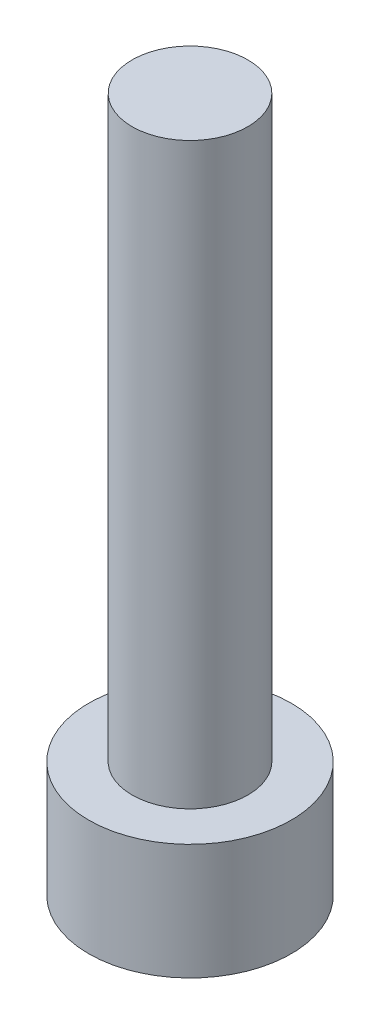
ISO-10303-21;
HEADER;
FILE_DESCRIPTION(('STEP AP214'),'2;1');
FILE_NAME('part.step','',(''),(''),'','','');
FILE_SCHEMA(('AUTOMOTIVE_DESIGN { 1 0 10303 214 1 1 1 1 }'));
ENDSEC;
DATA;
#1=APPLICATION_CONTEXT('core data for automotive mechanical design processes');
#2=APPLICATION_PROTOCOL_DEFINITION('international standard','automotive_design',2000,#1);
#3=PRODUCT_CONTEXT('',#1,'mechanical');
#4=PRODUCT('Part','Part','',(#3));
#5=PRODUCT_RELATED_PRODUCT_CATEGORY('part','',(#4));
#6=PRODUCT_DEFINITION_FORMATION('','',#4);
#7=PRODUCT_DEFINITION_CONTEXT('part definition',#1,'design');
#8=PRODUCT_DEFINITION('design','',#6,#7);
#9=PRODUCT_DEFINITION_SHAPE('','',#8);
#10=(LENGTH_UNIT() NAMED_UNIT(*) SI_UNIT(.MILLI.,.METRE.));
#11=(NAMED_UNIT(*) PLANE_ANGLE_UNIT() SI_UNIT($,.RADIAN.));
#12=(NAMED_UNIT(*) SI_UNIT($,.STERADIAN.) SOLID_ANGLE_UNIT());
#13=UNCERTAINTY_MEASURE_WITH_UNIT(LENGTH_MEASURE(1.E-05),#10,'distance_accuracy_value','');
#14=(GEOMETRIC_REPRESENTATION_CONTEXT(3) GLOBAL_UNCERTAINTY_ASSIGNED_CONTEXT((#13)) GLOBAL_UNIT_ASSIGNED_CONTEXT((#10,
#11,#12)) REPRESENTATION_CONTEXT('',''));
#15=CARTESIAN_POINT('',(0.,0.,0.));
#16=DIRECTION('',(0.,0.,1.));
#17=DIRECTION('',(1.,0.,0.));
#18=AXIS2_PLACEMENT_3D('',#15,#16,#17);
#19=CARTESIAN_POINT('',(0.,4.,0.));
#20=DIRECTION('',(0.,-1.,0.));
#21=DIRECTION('',(0.,0.,-1.));
#22=AXIS2_PLACEMENT_3D('',#19,#20,#21);
#23=CYLINDRICAL_SURFACE('',#22,3.5);
#24=CARTESIAN_POINT('',(0.,4.,0.));
#25=DIRECTION('',(0.,1.,0.));
#26=DIRECTION('',(0.,0.,1.));
#27=AXIS2_PLACEMENT_3D('',#24,#25,#26);
#28=CIRCLE('',#27,3.5);
#29=CARTESIAN_POINT('',(0.,4.,3.5));
#30=VERTEX_POINT('',#29);
#31=EDGE_CURVE('E44',#30,#30,#28,.T.);
#32=ORIENTED_EDGE('',*,*,#31,.F.);
#33=EDGE_LOOP('',(#32));
#34=FACE_BOUND('',#33,.T.);
#35=CARTESIAN_POINT('',(0.,0.,0.));
#36=DIRECTION('',(0.,1.,0.));
#37=DIRECTION('',(0.,0.,1.));
#38=AXIS2_PLACEMENT_3D('',#35,#36,#37);
#39=CIRCLE('',#38,3.5);
#40=CARTESIAN_POINT('',(0.,0.,3.5));
#41=VERTEX_POINT('',#40);
#42=EDGE_CURVE('E40',#41,#41,#39,.T.);
#43=ORIENTED_EDGE('',*,*,#42,.T.);
#44=EDGE_LOOP('',(#43));
#45=FACE_BOUND('',#44,.T.);
#46=ADVANCED_FACE('F37',(#34,#45),#23,.T.);
#47=CARTESIAN_POINT('',(0.,4.,0.));
#48=DIRECTION('',(0.,1.,0.));
#49=DIRECTION('',(0.,0.,1.));
#50=AXIS2_PLACEMENT_3D('',#47,#48,#49);
#51=PLANE('',#50);
#52=CARTESIAN_POINT('',(0.,4.,0.));
#53=DIRECTION('',(0.,1.,0.));
#54=DIRECTION('',(0.,0.,1.));
#55=AXIS2_PLACEMENT_3D('',#52,#53,#54);
#56=CIRCLE('',#55,2.);
#57=CARTESIAN_POINT('',(0.,4.,2.));
#58=VERTEX_POINT('',#57);
#59=EDGE_CURVE('E10',#58,#58,#56,.T.);
#60=ORIENTED_EDGE('',*,*,#59,.F.);
#61=EDGE_LOOP('',(#60));
#62=FACE_BOUND('',#61,.T.);
#63=ORIENTED_EDGE('',*,*,#31,.T.);
#64=EDGE_LOOP('',(#63));
#65=FACE_BOUND('',#64,.T.);
#66=ADVANCED_FACE('F61',(#62,#65),#51,.T.);
#67=CARTESIAN_POINT('',(0.,0.,0.));
#68=DIRECTION('',(0.,1.,0.));
#69=DIRECTION('',(0.,0.,1.));
#70=AXIS2_PLACEMENT_3D('',#67,#68,#69);
#71=PLANE('',#70);
#72=ORIENTED_EDGE('',*,*,#42,.F.);
#73=EDGE_LOOP('',(#72));
#74=FACE_BOUND('',#73,.T.);
#75=ADVANCED_FACE('F58',(#74),#71,.F.);
#76=CARTESIAN_POINT('',(0.,24.,0.));
#77=DIRECTION('',(0.,-1.,0.));
#78=DIRECTION('',(0.,0.,-1.));
#79=AXIS2_PLACEMENT_3D('',#76,#77,#78);
#80=CYLINDRICAL_SURFACE('',#79,2.);
#81=CARTESIAN_POINT('',(0.,24.,0.));
#82=DIRECTION('',(0.,1.,0.));
#83=DIRECTION('',(0.,0.,1.));
#84=AXIS2_PLACEMENT_3D('',#81,#82,#83);
#85=CIRCLE('',#84,2.);
#86=CARTESIAN_POINT('',(0.,24.,2.));
#87=VERTEX_POINT('',#86);
#88=EDGE_CURVE('E50',#87,#87,#85,.T.);
#89=ORIENTED_EDGE('',*,*,#88,.F.);
#90=EDGE_LOOP('',(#89));
#91=FACE_BOUND('',#90,.T.);
#92=ORIENTED_EDGE('',*,*,#59,.T.);
#93=EDGE_LOOP('',(#92));
#94=FACE_BOUND('',#93,.T.);
#95=ADVANCED_FACE('F60',(#91,#94),#80,.T.);
#96=CARTESIAN_POINT('',(0.,24.,0.));
#97=DIRECTION('',(0.,1.,0.));
#98=DIRECTION('',(0.,0.,1.));
#99=AXIS2_PLACEMENT_3D('',#96,#97,#98);
#100=PLANE('',#99);
#101=ORIENTED_EDGE('',*,*,#88,.T.);
#102=EDGE_LOOP('',(#101));
#103=FACE_BOUND('',#102,.T.);
#104=ADVANCED_FACE('F66',(#103),#100,.T.);
#105=CLOSED_SHELL('',(#46,#66,#75,#95,#104));
#106=MANIFOLD_SOLID_BREP('B2',#105);
#107=ADVANCED_BREP_SHAPE_REPRESENTATION('',(#18,#106),#14);
#108=SHAPE_DEFINITION_REPRESENTATION(#9,#107);
ENDSEC;
END-ISO-10303-21;
